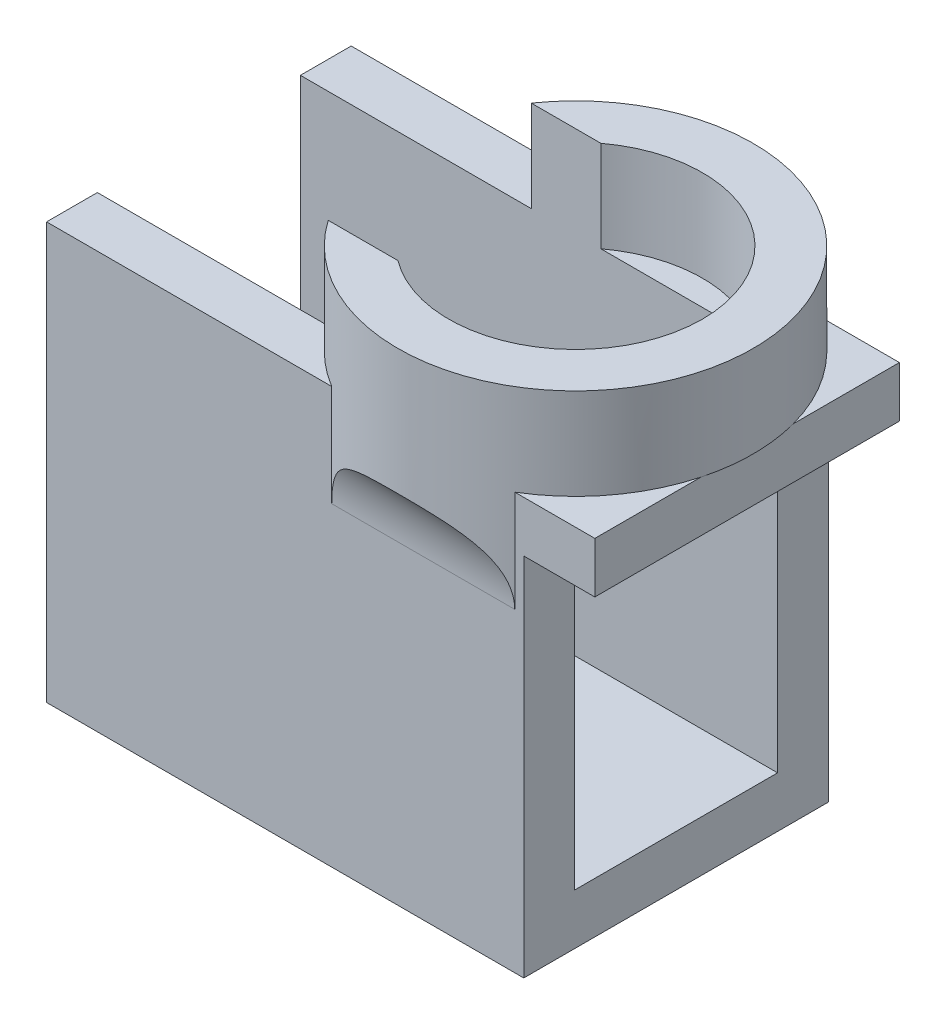
ISO-10303-21;
HEADER;
FILE_DESCRIPTION(('STEP AP214'),'2;1');
FILE_NAME('part.step','',(''),(''),'','','');
FILE_SCHEMA(('AUTOMOTIVE_DESIGN { 1 0 10303 214 1 1 1 1 }'));
ENDSEC;
DATA;
#1=APPLICATION_CONTEXT('core data for automotive mechanical design processes');
#2=APPLICATION_PROTOCOL_DEFINITION('international standard','automotive_design',2000,#1);
#3=PRODUCT_CONTEXT('',#1,'mechanical');
#4=PRODUCT('Part','Part','',(#3));
#5=PRODUCT_RELATED_PRODUCT_CATEGORY('part','',(#4));
#6=PRODUCT_DEFINITION_FORMATION('','',#4);
#7=PRODUCT_DEFINITION_CONTEXT('part definition',#1,'design');
#8=PRODUCT_DEFINITION('design','',#6,#7);
#9=PRODUCT_DEFINITION_SHAPE('','',#8);
#10=(LENGTH_UNIT() NAMED_UNIT(*) SI_UNIT(.MILLI.,.METRE.));
#11=(NAMED_UNIT(*) PLANE_ANGLE_UNIT() SI_UNIT($,.RADIAN.));
#12=(NAMED_UNIT(*) SI_UNIT($,.STERADIAN.) SOLID_ANGLE_UNIT());
#13=UNCERTAINTY_MEASURE_WITH_UNIT(LENGTH_MEASURE(1.E-05),#10,'distance_accuracy_value','');
#14=(GEOMETRIC_REPRESENTATION_CONTEXT(3) GLOBAL_UNCERTAINTY_ASSIGNED_CONTEXT((#13)) GLOBAL_UNIT_ASSIGNED_CONTEXT((#10,
#11,#12)) REPRESENTATION_CONTEXT('',''));
#15=CARTESIAN_POINT('',(0.,0.,0.));
#16=DIRECTION('',(0.,0.,1.));
#17=DIRECTION('',(1.,0.,0.));
#18=AXIS2_PLACEMENT_3D('',#15,#16,#17);
#19=CARTESIAN_POINT('',(0.,41.,0.));
#20=DIRECTION('',(0.,1.,0.));
#21=DIRECTION('',(0.,0.,1.));
#22=AXIS2_PLACEMENT_3D('',#19,#20,#21);
#23=PLANE('',#22);
#24=CARTESIAN_POINT('',(37.1,41.,-15.));
#25=DIRECTION('',(0.,1.,0.));
#26=DIRECTION('',(0.,0.,1.));
#27=AXIS2_PLACEMENT_3D('',#24,#25,#26);
#28=CIRCLE('',#27,17.5);
#29=CARTESIAN_POINT('',(22.7385933836549,41.,-5.));
#30=VERTEX_POINT('',#29);
#31=CARTESIAN_POINT('',(28.08612181134,41.,0.));
#32=VERTEX_POINT('',#31);
#33=EDGE_CURVE('E365',#30,#32,#28,.T.);
#34=ORIENTED_EDGE('',*,*,#33,.F.);
#35=DIRECTION('',(-1.,0.,0.));
#36=VECTOR('',#35,1.);
#37=CARTESIAN_POINT('',(0.,41.,-5.));
#38=LINE('',#37,#36);
#39=CARTESIAN_POINT('',(0.,41.,-5.));
#40=VERTEX_POINT('',#39);
#41=EDGE_CURVE('E273',#30,#40,#38,.T.);
#42=ORIENTED_EDGE('',*,*,#41,.T.);
#43=DIRECTION('',(0.,0.,1.));
#44=VECTOR('',#43,1.);
#45=CARTESIAN_POINT('',(0.,41.,0.));
#46=LINE('',#45,#44);
#47=CARTESIAN_POINT('',(0.,41.,0.));
#48=VERTEX_POINT('',#47);
#49=EDGE_CURVE('E264',#40,#48,#46,.T.);
#50=ORIENTED_EDGE('',*,*,#49,.T.);
#51=DIRECTION('',(1.,0.,0.));
#52=VECTOR('',#51,1.);
#53=CARTESIAN_POINT('',(0.,41.,0.));
#54=LINE('',#53,#52);
#55=EDGE_CURVE('E269',#48,#32,#54,.T.);
#56=ORIENTED_EDGE('',*,*,#55,.T.);
#57=EDGE_LOOP('',(#34,#42,#50,#56));
#58=FACE_BOUND('',#57,.T.);
#59=ADVANCED_FACE('F41',(#58),#23,.T.);
#60=CARTESIAN_POINT('',(46.11387818866,41.,0.));
#61=VERTEX_POINT('',#60);
#62=CARTESIAN_POINT('',(54.,41.,-10.4568733233598));
#63=VERTEX_POINT('',#62);
#64=EDGE_CURVE('E352',#61,#63,#28,.T.);
#65=ORIENTED_EDGE('',*,*,#64,.F.);
#66=CARTESIAN_POINT('',(54.,41.,0.));
#67=VERTEX_POINT('',#66);
#68=EDGE_CURVE('E268',#61,#67,#54,.T.);
#69=ORIENTED_EDGE('',*,*,#68,.T.);
#70=DIRECTION('',(0.,0.,-1.));
#71=VECTOR('',#70,1.);
#72=CARTESIAN_POINT('',(54.,41.,-30.));
#73=LINE('',#72,#71);
#74=EDGE_CURVE('E298',#67,#63,#73,.T.);
#75=ORIENTED_EDGE('',*,*,#74,.T.);
#76=EDGE_LOOP('',(#65,#69,#75));
#77=FACE_BOUND('',#76,.T.);
#78=ADVANCED_FACE('F153',(#77),#23,.T.);
#79=CARTESIAN_POINT('',(54.,41.,-19.5431266766402));
#80=VERTEX_POINT('',#79);
#81=CARTESIAN_POINT('',(46.11387818866,41.,-30.));
#82=VERTEX_POINT('',#81);
#83=EDGE_CURVE('E100',#80,#82,#28,.T.);
#84=ORIENTED_EDGE('',*,*,#83,.F.);
#85=CARTESIAN_POINT('',(54.,41.,-30.));
#86=VERTEX_POINT('',#85);
#87=EDGE_CURVE('E296',#80,#86,#73,.T.);
#88=ORIENTED_EDGE('',*,*,#87,.T.);
#89=DIRECTION('',(-1.,0.,0.));
#90=VECTOR('',#89,1.);
#91=CARTESIAN_POINT('',(0.,41.,-30.));
#92=LINE('',#91,#90);
#93=EDGE_CURVE('E304',#86,#82,#92,.T.);
#94=ORIENTED_EDGE('',*,*,#93,.T.);
#95=EDGE_LOOP('',(#84,#88,#94));
#96=FACE_BOUND('',#95,.T.);
#97=ADVANCED_FACE('F590',(#96),#23,.T.);
#98=CARTESIAN_POINT('',(28.08612181134,41.,-30.));
#99=VERTEX_POINT('',#98);
#100=CARTESIAN_POINT('',(22.7385933836549,41.,-25.));
#101=VERTEX_POINT('',#100);
#102=EDGE_CURVE('E441',#99,#101,#28,.T.);
#103=ORIENTED_EDGE('',*,*,#102,.F.);
#104=CARTESIAN_POINT('',(0.,41.,-30.));
#105=VERTEX_POINT('',#104);
#106=EDGE_CURVE('E302',#99,#105,#92,.T.);
#107=ORIENTED_EDGE('',*,*,#106,.T.);
#108=DIRECTION('',(0.,0.,1.));
#109=VECTOR('',#108,1.);
#110=CARTESIAN_POINT('',(0.,41.,-30.));
#111=LINE('',#110,#109);
#112=CARTESIAN_POINT('',(0.,41.,-25.));
#113=VERTEX_POINT('',#112);
#114=EDGE_CURVE('E287',#105,#113,#111,.T.);
#115=ORIENTED_EDGE('',*,*,#114,.T.);
#116=DIRECTION('',(1.,0.,0.));
#117=VECTOR('',#116,1.);
#118=CARTESIAN_POINT('',(0.,41.,-25.));
#119=LINE('',#118,#117);
#120=EDGE_CURVE('E292',#113,#101,#119,.T.);
#121=ORIENTED_EDGE('',*,*,#120,.T.);
#122=EDGE_LOOP('',(#103,#107,#115,#121));
#123=FACE_BOUND('',#122,.T.);
#124=ADVANCED_FACE('F524',(#123),#23,.T.);
#125=CARTESIAN_POINT('',(37.1,41.,-15.));
#126=DIRECTION('',(0.,-1.,0.));
#127=DIRECTION('',(0.,0.,1.));
#128=AXIS2_PLACEMENT_3D('',#125,#126,#127);
#129=CIRCLE('',#128,12.5);
#130=CARTESIAN_POINT('',(29.6,41.,-25.));
#131=VERTEX_POINT('',#130);
#132=CARTESIAN_POINT('',(44.6,41.,-25.));
#133=VERTEX_POINT('',#132);
#134=EDGE_CURVE('E459',#131,#133,#129,.T.);
#135=ORIENTED_EDGE('',*,*,#134,.F.);
#136=EDGE_CURVE('E297',#131,#133,#119,.T.);
#137=ORIENTED_EDGE('',*,*,#136,.T.);
#138=EDGE_LOOP('',(#135,#137));
#139=FACE_BOUND('',#138,.T.);
#140=ADVANCED_FACE('F538',(#139),#23,.T.);
#141=CARTESIAN_POINT('',(47.,41.,-22.6315136113356));
#142=VERTEX_POINT('',#141);
#143=CARTESIAN_POINT('',(47.,41.,-7.36848638866444));
#144=VERTEX_POINT('',#143);
#145=EDGE_CURVE('E447',#142,#144,#129,.T.);
#146=ORIENTED_EDGE('',*,*,#145,.F.);
#147=DIRECTION('',(0.,0.,1.));
#148=VECTOR('',#147,1.);
#149=CARTESIAN_POINT('',(47.,41.,-25.));
#150=LINE('',#149,#148);
#151=EDGE_CURVE('E253',#142,#144,#150,.T.);
#152=ORIENTED_EDGE('',*,*,#151,.T.);
#153=EDGE_LOOP('',(#146,#152));
#154=FACE_BOUND('',#153,.T.);
#155=ADVANCED_FACE('F581',(#154),#23,.T.);
#156=CARTESIAN_POINT('',(44.6,41.,-5.));
#157=VERTEX_POINT('',#156);
#158=CARTESIAN_POINT('',(29.6,41.,-5.));
#159=VERTEX_POINT('',#158);
#160=EDGE_CURVE('E346',#157,#159,#129,.T.);
#161=ORIENTED_EDGE('',*,*,#160,.F.);
#162=EDGE_CURVE('E279',#157,#159,#38,.T.);
#163=ORIENTED_EDGE('',*,*,#162,.T.);
#164=EDGE_LOOP('',(#161,#163));
#165=FACE_BOUND('',#164,.T.);
#166=ADVANCED_FACE('F145',(#165),#23,.T.);
#167=CARTESIAN_POINT('',(0.,5.,0.));
#168=DIRECTION('',(0.,-1.,0.));
#169=DIRECTION('',(0.,0.,-1.));
#170=AXIS2_PLACEMENT_3D('',#167,#168,#169);
#171=PLANE('',#170);
#172=DIRECTION('',(-1.,0.,0.));
#173=VECTOR('',#172,1.);
#174=CARTESIAN_POINT('',(0.,5.,-5.));
#175=LINE('',#174,#173);
#176=CARTESIAN_POINT('',(47.,5.,-5.));
#177=VERTEX_POINT('',#176);
#178=CARTESIAN_POINT('',(0.,5.,-5.));
#179=VERTEX_POINT('',#178);
#180=EDGE_CURVE('E258',#177,#179,#175,.T.);
#181=ORIENTED_EDGE('',*,*,#180,.F.);
#182=DIRECTION('',(0.,0.,-1.));
#183=VECTOR('',#182,1.);
#184=CARTESIAN_POINT('',(47.,5.,0.));
#185=LINE('',#184,#183);
#186=CARTESIAN_POINT('',(47.,5.,-25.));
#187=VERTEX_POINT('',#186);
#188=EDGE_CURVE('E240',#177,#187,#185,.T.);
#189=ORIENTED_EDGE('',*,*,#188,.T.);
#190=DIRECTION('',(1.,0.,0.));
#191=VECTOR('',#190,1.);
#192=CARTESIAN_POINT('',(0.,5.,-25.));
#193=LINE('',#192,#191);
#194=CARTESIAN_POINT('',(0.,5.,-25.));
#195=VERTEX_POINT('',#194);
#196=EDGE_CURVE('E286',#195,#187,#193,.T.);
#197=ORIENTED_EDGE('',*,*,#196,.F.);
#198=DIRECTION('',(0.,0.,1.));
#199=VECTOR('',#198,1.);
#200=CARTESIAN_POINT('',(0.,5.,0.));
#201=LINE('',#200,#199);
#202=EDGE_CURVE('E315',#195,#179,#201,.T.);
#203=ORIENTED_EDGE('',*,*,#202,.T.);
#204=EDGE_LOOP('',(#181,#189,#197,#203));
#205=FACE_BOUND('',#204,.T.);
#206=ADVANCED_FACE('F127',(#205),#171,.F.);
#207=CARTESIAN_POINT('',(0.,5.,0.));
#208=DIRECTION('',(1.,0.,0.));
#209=DIRECTION('',(0.,0.,-1.));
#210=AXIS2_PLACEMENT_3D('',#207,#208,#209);
#211=PLANE('',#210);
#212=CARTESIAN_POINT('',(0.,5.,-27.5));
#213=DIRECTION('',(-1.,0.,0.));
#214=DIRECTION('',(0.,0.,1.));
#215=AXIS2_PLACEMENT_3D('',#212,#213,#214);
#216=CIRCLE('',#215,1.5);
#217=CARTESIAN_POINT('',(0.,5.,-26.));
#218=VERTEX_POINT('',#217);
#219=EDGE_CURVE('E197',#218,#218,#216,.T.);
#220=ORIENTED_EDGE('',*,*,#219,.F.);
#221=EDGE_LOOP('',(#220));
#222=FACE_BOUND('',#221,.T.);
#223=CARTESIAN_POINT('',(0.,5.,-2.5));
#224=DIRECTION('',(-1.,0.,0.));
#225=DIRECTION('',(0.,0.,1.));
#226=AXIS2_PLACEMENT_3D('',#223,#224,#225);
#227=CIRCLE('',#226,1.5);
#228=CARTESIAN_POINT('',(0.,5.,-0.999999999999998));
#229=VERTEX_POINT('',#228);
#230=EDGE_CURVE('E214',#229,#229,#227,.T.);
#231=ORIENTED_EDGE('',*,*,#230,.F.);
#232=EDGE_LOOP('',(#231));
#233=FACE_BOUND('',#232,.T.);
#234=DIRECTION('',(0.,0.,1.));
#235=VECTOR('',#234,1.);
#236=CARTESIAN_POINT('',(0.,0.,0.));
#237=LINE('',#236,#235);
#238=CARTESIAN_POINT('',(0.,0.,-30.));
#239=VERTEX_POINT('',#238);
#240=CARTESIAN_POINT('',(0.,0.,0.));
#241=VERTEX_POINT('',#240);
#242=EDGE_CURVE('E314',#239,#241,#237,.T.);
#243=ORIENTED_EDGE('',*,*,#242,.T.);
#244=DIRECTION('',(0.,-1.,0.));
#245=VECTOR('',#244,1.);
#246=CARTESIAN_POINT('',(0.,5.,0.));
#247=LINE('',#246,#245);
#248=EDGE_CURVE('E342',#48,#241,#247,.T.);
#249=ORIENTED_EDGE('',*,*,#248,.F.);
#250=ORIENTED_EDGE('',*,*,#49,.F.);
#251=DIRECTION('',(0.,-1.,0.));
#252=VECTOR('',#251,1.);
#253=CARTESIAN_POINT('',(0.,41.,-5.));
#254=LINE('',#253,#252);
#255=EDGE_CURVE('E278',#40,#179,#254,.T.);
#256=ORIENTED_EDGE('',*,*,#255,.T.);
#257=ORIENTED_EDGE('',*,*,#202,.F.);
#258=DIRECTION('',(0.,-1.,0.));
#259=VECTOR('',#258,1.);
#260=CARTESIAN_POINT('',(0.,41.,-25.));
#261=LINE('',#260,#259);
#262=EDGE_CURVE('E307',#113,#195,#261,.T.);
#263=ORIENTED_EDGE('',*,*,#262,.F.);
#264=ORIENTED_EDGE('',*,*,#114,.F.);
#265=DIRECTION('',(0.,-1.,0.));
#266=VECTOR('',#265,1.);
#267=CARTESIAN_POINT('',(0.,5.,-30.));
#268=LINE('',#267,#266);
#269=EDGE_CURVE('E319',#105,#239,#268,.T.);
#270=ORIENTED_EDGE('',*,*,#269,.T.);
#271=EDGE_LOOP('',(#243,#249,#250,#256,#257,#263,#264,#270));
#272=FACE_BOUND('',#271,.T.);
#273=ADVANCED_FACE('F123',(#222,#233,#272),#211,.F.);
#274=CARTESIAN_POINT('',(0.,5.,0.));
#275=DIRECTION('',(0.,0.,-1.));
#276=DIRECTION('',(-1.,0.,0.));
#277=AXIS2_PLACEMENT_3D('',#274,#275,#276);
#278=PLANE('',#277);
#279=ORIENTED_EDGE('',*,*,#68,.F.);
#280=DIRECTION('',(0.,-1.,0.));
#281=VECTOR('',#280,1.);
#282=CARTESIAN_POINT('',(46.11387818866,41.,0.));
#283=LINE('',#282,#281);
#284=CARTESIAN_POINT('',(46.11387818866,31.,0.));
#285=VERTEX_POINT('',#284);
#286=EDGE_CURVE('E102',#61,#285,#283,.T.);
#287=ORIENTED_EDGE('',*,*,#286,.T.);
#288=DIRECTION('',(1.,0.,0.));
#289=VECTOR('',#288,1.);
#290=CARTESIAN_POINT('',(28.08612181134,31.,0.));
#291=LINE('',#290,#289);
#292=CARTESIAN_POINT('',(28.08612181134,31.,0.));
#293=VERTEX_POINT('',#292);
#294=EDGE_CURVE('E351',#285,#293,#291,.F.);
#295=ORIENTED_EDGE('',*,*,#294,.T.);
#296=DIRECTION('',(0.,-1.,0.));
#297=VECTOR('',#296,1.);
#298=CARTESIAN_POINT('',(28.08612181134,31.,0.));
#299=LINE('',#298,#297);
#300=EDGE_CURVE('E347',#293,#32,#299,.F.);
#301=ORIENTED_EDGE('',*,*,#300,.T.);
#302=ORIENTED_EDGE('',*,*,#55,.F.);
#303=ORIENTED_EDGE('',*,*,#248,.T.);
#304=DIRECTION('',(1.,0.,0.));
#305=VECTOR('',#304,1.);
#306=CARTESIAN_POINT('',(0.,0.,0.));
#307=LINE('',#306,#305);
#308=CARTESIAN_POINT('',(47.,0.,0.));
#309=VERTEX_POINT('',#308);
#310=EDGE_CURVE('E324',#241,#309,#307,.T.);
#311=ORIENTED_EDGE('',*,*,#310,.T.);
#312=DIRECTION('',(0.,-1.,0.));
#313=VECTOR('',#312,1.);
#314=CARTESIAN_POINT('',(47.,36.,0.));
#315=LINE('',#314,#313);
#316=CARTESIAN_POINT('',(47.,36.,0.));
#317=VERTEX_POINT('',#316);
#318=EDGE_CURVE('E234',#317,#309,#315,.T.);
#319=ORIENTED_EDGE('',*,*,#318,.F.);
#320=DIRECTION('',(-1.,0.,0.));
#321=VECTOR('',#320,1.);
#322=CARTESIAN_POINT('',(54.,36.,0.));
#323=LINE('',#322,#321);
#324=CARTESIAN_POINT('',(54.,36.,0.));
#325=VERTEX_POINT('',#324);
#326=EDGE_CURVE('E221',#325,#317,#323,.T.);
#327=ORIENTED_EDGE('',*,*,#326,.F.);
#328=DIRECTION('',(0.,-1.,0.));
#329=VECTOR('',#328,1.);
#330=CARTESIAN_POINT('',(54.,5.,0.));
#331=LINE('',#330,#329);
#332=EDGE_CURVE('E338',#67,#325,#331,.T.);
#333=ORIENTED_EDGE('',*,*,#332,.F.);
#334=EDGE_LOOP('',(#279,#287,#295,#301,#302,#303,#311,#319,#327,#333));
#335=FACE_BOUND('',#334,.T.);
#336=ADVANCED_FACE('F126',(#335),#278,.F.);
#337=CARTESIAN_POINT('',(54.,5.,0.));
#338=DIRECTION('',(-1.,0.,0.));
#339=DIRECTION('',(0.,0.,1.));
#340=AXIS2_PLACEMENT_3D('',#337,#338,#339);
#341=PLANE('',#340);
#342=ORIENTED_EDGE('',*,*,#332,.T.);
#343=DIRECTION('',(0.,0.,1.));
#344=VECTOR('',#343,1.);
#345=CARTESIAN_POINT('',(54.,36.,0.));
#346=LINE('',#345,#344);
#347=CARTESIAN_POINT('',(54.,36.,-30.));
#348=VERTEX_POINT('',#347);
#349=EDGE_CURVE('E202',#348,#325,#346,.T.);
#350=ORIENTED_EDGE('',*,*,#349,.F.);
#351=DIRECTION('',(0.,-1.,0.));
#352=VECTOR('',#351,1.);
#353=CARTESIAN_POINT('',(54.,5.,-30.));
#354=LINE('',#353,#352);
#355=EDGE_CURVE('E334',#86,#348,#354,.T.);
#356=ORIENTED_EDGE('',*,*,#355,.F.);
#357=ORIENTED_EDGE('',*,*,#87,.F.);
#358=EDGE_CURVE('E303',#63,#80,#73,.T.);
#359=ORIENTED_EDGE('',*,*,#358,.F.);
#360=ORIENTED_EDGE('',*,*,#74,.F.);
#361=EDGE_LOOP('',(#342,#350,#356,#357,#359,#360));
#362=FACE_BOUND('',#361,.T.);
#363=ADVANCED_FACE('F131',(#362),#341,.F.);
#364=CARTESIAN_POINT('',(0.,5.,-30.));
#365=DIRECTION('',(0.,0.,1.));
#366=DIRECTION('',(1.,0.,0.));
#367=AXIS2_PLACEMENT_3D('',#364,#365,#366);
#368=PLANE('',#367);
#369=ORIENTED_EDGE('',*,*,#106,.F.);
#370=DIRECTION('',(0.,-1.,0.));
#371=VECTOR('',#370,1.);
#372=CARTESIAN_POINT('',(28.08612181134,41.,-30.));
#373=LINE('',#372,#371);
#374=CARTESIAN_POINT('',(28.08612181134,31.,-30.));
#375=VERTEX_POINT('',#374);
#376=EDGE_CURVE('E64',#99,#375,#373,.T.);
#377=ORIENTED_EDGE('',*,*,#376,.T.);
#378=DIRECTION('',(-1.,0.,0.));
#379=VECTOR('',#378,1.);
#380=CARTESIAN_POINT('',(46.11387818866,31.,-30.));
#381=LINE('',#380,#379);
#382=CARTESIAN_POINT('',(46.11387818866,31.,-30.));
#383=VERTEX_POINT('',#382);
#384=EDGE_CURVE('E95',#375,#383,#381,.F.);
#385=ORIENTED_EDGE('',*,*,#384,.T.);
#386=DIRECTION('',(0.,-1.,0.));
#387=VECTOR('',#386,1.);
#388=CARTESIAN_POINT('',(46.11387818866,31.,-30.));
#389=LINE('',#388,#387);
#390=EDGE_CURVE('E86',#383,#82,#389,.F.);
#391=ORIENTED_EDGE('',*,*,#390,.T.);
#392=ORIENTED_EDGE('',*,*,#93,.F.);
#393=ORIENTED_EDGE('',*,*,#355,.T.);
#394=DIRECTION('',(1.,0.,0.));
#395=VECTOR('',#394,1.);
#396=CARTESIAN_POINT('',(54.,36.,-30.));
#397=LINE('',#396,#395);
#398=CARTESIAN_POINT('',(47.,36.,-30.));
#399=VERTEX_POINT('',#398);
#400=EDGE_CURVE('E230',#399,#348,#397,.T.);
#401=ORIENTED_EDGE('',*,*,#400,.F.);
#402=DIRECTION('',(0.,-1.,0.));
#403=VECTOR('',#402,1.);
#404=CARTESIAN_POINT('',(47.,36.,-30.));
#405=LINE('',#404,#403);
#406=CARTESIAN_POINT('',(47.,0.,-30.));
#407=VERTEX_POINT('',#406);
#408=EDGE_CURVE('E236',#399,#407,#405,.T.);
#409=ORIENTED_EDGE('',*,*,#408,.T.);
#410=DIRECTION('',(-1.,0.,0.));
#411=VECTOR('',#410,1.);
#412=CARTESIAN_POINT('',(0.,0.,-30.));
#413=LINE('',#412,#411);
#414=EDGE_CURVE('E320',#407,#239,#413,.T.);
#415=ORIENTED_EDGE('',*,*,#414,.T.);
#416=ORIENTED_EDGE('',*,*,#269,.F.);
#417=EDGE_LOOP('',(#369,#377,#385,#391,#392,#393,#401,#409,#415,#416));
#418=FACE_BOUND('',#417,.T.);
#419=ADVANCED_FACE('F104',(#418),#368,.F.);
#420=CARTESIAN_POINT('',(0.,0.,0.));
#421=DIRECTION('',(0.,-1.,0.));
#422=DIRECTION('',(0.,0.,-1.));
#423=AXIS2_PLACEMENT_3D('',#420,#421,#422);
#424=PLANE('',#423);
#425=DIRECTION('',(0.,0.,-1.));
#426=VECTOR('',#425,1.);
#427=CARTESIAN_POINT('',(47.,0.,0.));
#428=LINE('',#427,#426);
#429=EDGE_CURVE('E196',#309,#407,#428,.T.);
#430=ORIENTED_EDGE('',*,*,#429,.F.);
#431=ORIENTED_EDGE('',*,*,#310,.F.);
#432=ORIENTED_EDGE('',*,*,#242,.F.);
#433=ORIENTED_EDGE('',*,*,#414,.F.);
#434=EDGE_LOOP('',(#430,#431,#432,#433));
#435=FACE_BOUND('',#434,.T.);
#436=ADVANCED_FACE('F138',(#435),#424,.T.);
#437=CARTESIAN_POINT('',(0.,41.,-25.));
#438=DIRECTION('',(0.,0.,-1.));
#439=DIRECTION('',(-1.,0.,0.));
#440=AXIS2_PLACEMENT_3D('',#437,#438,#439);
#441=PLANE('',#440);
#442=ORIENTED_EDGE('',*,*,#196,.T.);
#443=DIRECTION('',(0.,1.,0.));
#444=VECTOR('',#443,1.);
#445=CARTESIAN_POINT('',(47.,31.,-25.));
#446=LINE('',#445,#444);
#447=CARTESIAN_POINT('',(47.,36.,-25.));
#448=VERTEX_POINT('',#447);
#449=EDGE_CURVE('E254',#187,#448,#446,.T.);
#450=ORIENTED_EDGE('',*,*,#449,.T.);
#451=CARTESIAN_POINT('',(47.,41.,-25.));
#452=VERTEX_POINT('',#451);
#453=EDGE_CURVE('E259',#448,#452,#446,.T.);
#454=ORIENTED_EDGE('',*,*,#453,.T.);
#455=EDGE_CURVE('E291',#133,#452,#119,.T.);
#456=ORIENTED_EDGE('',*,*,#455,.F.);
#457=ORIENTED_EDGE('',*,*,#136,.F.);
#458=DIRECTION('',(0.,-1.,0.));
#459=VECTOR('',#458,1.);
#460=CARTESIAN_POINT('',(29.6,50.,-25.));
#461=LINE('',#460,#459);
#462=CARTESIAN_POINT('',(29.6,50.,-25.));
#463=VERTEX_POINT('',#462);
#464=EDGE_CURVE('E540',#463,#131,#461,.T.);
#465=ORIENTED_EDGE('',*,*,#464,.F.);
#466=DIRECTION('',(1.,0.,0.));
#467=VECTOR('',#466,1.);
#468=CARTESIAN_POINT('',(22.7385933836549,50.,-25.));
#469=LINE('',#468,#467);
#470=CARTESIAN_POINT('',(22.7385933836549,50.,-25.));
#471=VERTEX_POINT('',#470);
#472=EDGE_CURVE('E559',#471,#463,#469,.T.);
#473=ORIENTED_EDGE('',*,*,#472,.F.);
#474=DIRECTION('',(0.,-1.,0.));
#475=VECTOR('',#474,1.);
#476=CARTESIAN_POINT('',(22.7385933836549,50.,-25.));
#477=LINE('',#476,#475);
#478=EDGE_CURVE('E208',#471,#101,#477,.T.);
#479=ORIENTED_EDGE('',*,*,#478,.T.);
#480=ORIENTED_EDGE('',*,*,#120,.F.);
#481=ORIENTED_EDGE('',*,*,#262,.T.);
#482=EDGE_LOOP('',(#442,#450,#454,#456,#457,#465,#473,#479,#480,#481));
#483=FACE_BOUND('',#482,.T.);
#484=ADVANCED_FACE('F141',(#483),#441,.F.);
#485=CARTESIAN_POINT('',(0.,41.,-5.));
#486=DIRECTION('',(0.,0.,1.));
#487=DIRECTION('',(1.,0.,0.));
#488=AXIS2_PLACEMENT_3D('',#485,#486,#487);
#489=PLANE('',#488);
#490=DIRECTION('',(0.,1.,0.));
#491=VECTOR('',#490,1.);
#492=CARTESIAN_POINT('',(47.,31.,-5.));
#493=LINE('',#492,#491);
#494=CARTESIAN_POINT('',(47.,36.,-5.));
#495=VERTEX_POINT('',#494);
#496=EDGE_CURVE('E260',#177,#495,#493,.T.);
#497=ORIENTED_EDGE('',*,*,#496,.F.);
#498=ORIENTED_EDGE('',*,*,#180,.T.);
#499=ORIENTED_EDGE('',*,*,#255,.F.);
#500=ORIENTED_EDGE('',*,*,#41,.F.);
#501=DIRECTION('',(0.,-1.,0.));
#502=VECTOR('',#501,1.);
#503=CARTESIAN_POINT('',(22.7385933836549,50.,-5.));
#504=LINE('',#503,#502);
#505=CARTESIAN_POINT('',(22.7385933836549,50.,-5.));
#506=VERTEX_POINT('',#505);
#507=EDGE_CURVE('E548',#506,#30,#504,.T.);
#508=ORIENTED_EDGE('',*,*,#507,.F.);
#509=DIRECTION('',(-1.,0.,0.));
#510=VECTOR('',#509,1.);
#511=CARTESIAN_POINT('',(22.7385933836549,50.,-5.));
#512=LINE('',#511,#510);
#513=CARTESIAN_POINT('',(29.6,50.,-5.));
#514=VERTEX_POINT('',#513);
#515=EDGE_CURVE('E551',#514,#506,#512,.T.);
#516=ORIENTED_EDGE('',*,*,#515,.F.);
#517=DIRECTION('',(0.,-1.,0.));
#518=VECTOR('',#517,1.);
#519=CARTESIAN_POINT('',(29.6,50.,-5.));
#520=LINE('',#519,#518);
#521=EDGE_CURVE('E480',#514,#159,#520,.T.);
#522=ORIENTED_EDGE('',*,*,#521,.T.);
#523=ORIENTED_EDGE('',*,*,#162,.F.);
#524=CARTESIAN_POINT('',(47.,41.,-5.));
#525=VERTEX_POINT('',#524);
#526=EDGE_CURVE('E274',#525,#157,#38,.T.);
#527=ORIENTED_EDGE('',*,*,#526,.F.);
#528=EDGE_CURVE('E252',#495,#525,#493,.T.);
#529=ORIENTED_EDGE('',*,*,#528,.F.);
#530=EDGE_LOOP('',(#497,#498,#499,#500,#508,#516,#522,#523,#527,#529));
#531=FACE_BOUND('',#530,.T.);
#532=ADVANCED_FACE('F149',(#531),#489,.F.);
#533=CARTESIAN_POINT('',(47.,31.,-25.));
#534=DIRECTION('',(-1.,0.,0.));
#535=DIRECTION('',(0.,0.,1.));
#536=AXIS2_PLACEMENT_3D('',#533,#534,#535);
#537=PLANE('',#536);
#538=DIRECTION('',(0.,0.,-1.));
#539=VECTOR('',#538,1.);
#540=CARTESIAN_POINT('',(47.,36.,0.));
#541=LINE('',#540,#539);
#542=EDGE_CURVE('E231',#495,#448,#541,.T.);
#543=ORIENTED_EDGE('',*,*,#542,.F.);
#544=ORIENTED_EDGE('',*,*,#528,.T.);
#545=EDGE_CURVE('E247',#144,#525,#150,.T.);
#546=ORIENTED_EDGE('',*,*,#545,.F.);
#547=ORIENTED_EDGE('',*,*,#151,.F.);
#548=EDGE_CURVE('E248',#452,#142,#150,.T.);
#549=ORIENTED_EDGE('',*,*,#548,.F.);
#550=ORIENTED_EDGE('',*,*,#453,.F.);
#551=EDGE_LOOP('',(#543,#544,#546,#547,#549,#550));
#552=FACE_BOUND('',#551,.T.);
#553=ADVANCED_FACE('F157',(#552),#537,.T.);
#554=CARTESIAN_POINT('',(47.,36.,0.));
#555=DIRECTION('',(-1.,0.,0.));
#556=DIRECTION('',(0.,0.,1.));
#557=AXIS2_PLACEMENT_3D('',#554,#555,#556);
#558=PLANE('',#557);
#559=EDGE_CURVE('E226',#317,#495,#541,.T.);
#560=ORIENTED_EDGE('',*,*,#559,.F.);
#561=ORIENTED_EDGE('',*,*,#318,.T.);
#562=ORIENTED_EDGE('',*,*,#429,.T.);
#563=ORIENTED_EDGE('',*,*,#408,.F.);
#564=EDGE_CURVE('E225',#448,#399,#541,.T.);
#565=ORIENTED_EDGE('',*,*,#564,.F.);
#566=ORIENTED_EDGE('',*,*,#449,.F.);
#567=ORIENTED_EDGE('',*,*,#188,.F.);
#568=ORIENTED_EDGE('',*,*,#496,.T.);
#569=EDGE_LOOP('',(#560,#561,#562,#563,#565,#566,#567,#568));
#570=FACE_BOUND('',#569,.T.);
#571=ADVANCED_FACE('F161',(#570),#558,.F.);
#572=CARTESIAN_POINT('',(0.,36.,0.));
#573=DIRECTION('',(0.,1.,0.));
#574=DIRECTION('',(0.,0.,1.));
#575=AXIS2_PLACEMENT_3D('',#572,#573,#574);
#576=PLANE('',#575);
#577=ORIENTED_EDGE('',*,*,#349,.T.);
#578=ORIENTED_EDGE('',*,*,#326,.T.);
#579=ORIENTED_EDGE('',*,*,#559,.T.);
#580=ORIENTED_EDGE('',*,*,#542,.T.);
#581=ORIENTED_EDGE('',*,*,#564,.T.);
#582=ORIENTED_EDGE('',*,*,#400,.T.);
#583=EDGE_LOOP('',(#577,#578,#579,#580,#581,#582));
#584=FACE_BOUND('',#583,.T.);
#585=ADVANCED_FACE('F165',(#584),#576,.F.);
#586=CARTESIAN_POINT('',(5.,5.,-2.5));
#587=DIRECTION('',(-1.,0.,0.));
#588=DIRECTION('',(0.,0.,1.));
#589=AXIS2_PLACEMENT_3D('',#586,#587,#588);
#590=CYLINDRICAL_SURFACE('',#589,1.5);
#591=CARTESIAN_POINT('',(5.,5.,-2.5));
#592=DIRECTION('',(-1.,0.,0.));
#593=DIRECTION('',(0.,0.,1.));
#594=AXIS2_PLACEMENT_3D('',#591,#592,#593);
#595=CIRCLE('',#594,1.5);
#596=CARTESIAN_POINT('',(5.,5.,-0.999999999999998));
#597=VERTEX_POINT('',#596);
#598=EDGE_CURVE('E205',#597,#597,#595,.T.);
#599=ORIENTED_EDGE('',*,*,#598,.F.);
#600=EDGE_LOOP('',(#599));
#601=FACE_BOUND('',#600,.T.);
#602=ORIENTED_EDGE('',*,*,#230,.T.);
#603=EDGE_LOOP('',(#602));
#604=FACE_BOUND('',#603,.T.);
#605=ADVANCED_FACE('F169',(#601,#604),#590,.F.);
#606=CARTESIAN_POINT('',(5.,5.,-2.5));
#607=DIRECTION('',(-1.,0.,0.));
#608=DIRECTION('',(0.,0.,1.));
#609=AXIS2_PLACEMENT_3D('',#606,#607,#608);
#610=PLANE('',#609);
#611=ORIENTED_EDGE('',*,*,#598,.T.);
#612=EDGE_LOOP('',(#611));
#613=FACE_BOUND('',#612,.T.);
#614=ADVANCED_FACE('F173',(#613),#610,.T.);
#615=CARTESIAN_POINT('',(5.,5.,-27.5));
#616=DIRECTION('',(-1.,0.,0.));
#617=DIRECTION('',(0.,0.,1.));
#618=AXIS2_PLACEMENT_3D('',#615,#616,#617);
#619=CYLINDRICAL_SURFACE('',#618,1.5);
#620=CARTESIAN_POINT('',(5.,5.,-27.5));
#621=DIRECTION('',(-1.,0.,0.));
#622=DIRECTION('',(0.,0.,1.));
#623=AXIS2_PLACEMENT_3D('',#620,#621,#622);
#624=CIRCLE('',#623,1.5);
#625=CARTESIAN_POINT('',(5.,5.,-26.));
#626=VERTEX_POINT('',#625);
#627=EDGE_CURVE('E194',#626,#626,#624,.T.);
#628=ORIENTED_EDGE('',*,*,#627,.F.);
#629=EDGE_LOOP('',(#628));
#630=FACE_BOUND('',#629,.T.);
#631=ORIENTED_EDGE('',*,*,#219,.T.);
#632=EDGE_LOOP('',(#631));
#633=FACE_BOUND('',#632,.T.);
#634=ADVANCED_FACE('F177',(#630,#633),#619,.F.);
#635=CARTESIAN_POINT('',(5.,5.,-27.5));
#636=DIRECTION('',(-1.,0.,0.));
#637=DIRECTION('',(0.,0.,1.));
#638=AXIS2_PLACEMENT_3D('',#635,#636,#637);
#639=PLANE('',#638);
#640=ORIENTED_EDGE('',*,*,#627,.T.);
#641=EDGE_LOOP('',(#640));
#642=FACE_BOUND('',#641,.T.);
#643=ADVANCED_FACE('F180',(#642),#639,.T.);
#644=CARTESIAN_POINT('',(37.1,41.,-15.));
#645=DIRECTION('',(0.,1.,0.));
#646=DIRECTION('',(0.,0.,1.));
#647=AXIS2_PLACEMENT_3D('',#644,#645,#646);
#648=PLANE('',#647);
#649=EDGE_CURVE('E453',#133,#142,#129,.T.);
#650=ORIENTED_EDGE('',*,*,#649,.F.);
#651=ORIENTED_EDGE('',*,*,#455,.T.);
#652=ORIENTED_EDGE('',*,*,#548,.T.);
#653=EDGE_LOOP('',(#650,#651,#652));
#654=FACE_BOUND('',#653,.T.);
#655=ADVANCED_FACE('F183',(#654),#648,.F.);
#656=EDGE_CURVE('E440',#144,#157,#129,.T.);
#657=ORIENTED_EDGE('',*,*,#656,.F.);
#658=ORIENTED_EDGE('',*,*,#545,.T.);
#659=ORIENTED_EDGE('',*,*,#526,.T.);
#660=EDGE_LOOP('',(#657,#658,#659));
#661=FACE_BOUND('',#660,.T.);
#662=ADVANCED_FACE('F188',(#661),#648,.F.);
#663=EDGE_CURVE('E436',#63,#80,#28,.T.);
#664=ORIENTED_EDGE('',*,*,#663,.F.);
#665=ORIENTED_EDGE('',*,*,#358,.T.);
#666=EDGE_LOOP('',(#664,#665));
#667=FACE_BOUND('',#666,.T.);
#668=ADVANCED_FACE('F191',(#667),#648,.F.);
#669=CARTESIAN_POINT('',(37.1,50.,-15.));
#670=DIRECTION('',(0.,-1.,0.));
#671=DIRECTION('',(0.,0.,-1.));
#672=AXIS2_PLACEMENT_3D('',#669,#670,#671);
#673=CYLINDRICAL_SURFACE('',#672,17.5);
#674=ORIENTED_EDGE('',*,*,#33,.T.);
#675=ORIENTED_EDGE('',*,*,#300,.F.);
#676=CARTESIAN_POINT('',(28.08612181134,31.,0.));
#677=CARTESIAN_POINT('',(28.0860939070164,31.1665418513179,-4.37429430990452E-05));
#678=CARTESIAN_POINT('',(28.093043439622,31.3330663552599,0.00415869317904868));
#679=CARTESIAN_POINT('',(28.1206895773268,31.6644809721373,0.0207343091881698));
#680=CARTESIAN_POINT('',(28.1413794493952,31.8293718454386,0.0331034871972513));
#681=CARTESIAN_POINT('',(28.1961195708853,32.1550191425485,0.0655851821914614));
#682=CARTESIAN_POINT('',(28.2300817188553,32.3157955297215,0.0856466216860005));
#683=CARTESIAN_POINT('',(28.3109900267623,32.6329687072894,0.132928013225183));
#684=CARTESIAN_POINT('',(28.3579369149116,32.7893652515112,0.160148366752951));
#685=CARTESIAN_POINT('',(28.4642271563886,33.0963126075109,0.220944741949563));
#686=CARTESIAN_POINT('',(28.523550817122,33.246872260417,0.254510659367984));
#687=CARTESIAN_POINT('',(28.6540486457482,33.5414511337117,0.327148549411994));
#688=CARTESIAN_POINT('',(28.725228233115,33.6854673245174,0.366223038805575));
#689=CARTESIAN_POINT('',(28.8787508981822,33.9661406270347,0.448904598659306));
#690=CARTESIAN_POINT('',(28.9610992318409,34.1027942313876,0.492513800865579));
#691=CARTESIAN_POINT('',(29.1361583439367,34.368096436779,0.583227323780372));
#692=CARTESIAN_POINT('',(29.228873277119,34.4967417958702,0.630333043268819));
#693=CARTESIAN_POINT('',(29.5182884480425,34.8660713354468,0.7738178454822));
#694=CARTESIAN_POINT('',(29.7288000793962,35.0947192705041,0.87377086430731));
#695=CARTESIAN_POINT('',(30.1803540863088,35.5180685326273,1.07574752530892));
#696=CARTESIAN_POINT('',(30.4214042052407,35.7127612201013,1.17777168711762));
#697=CARTESIAN_POINT('',(30.8643783798239,36.024593221552,1.35263803946422));
#698=CARTESIAN_POINT('',(31.0609560138961,36.1489373565016,1.42638248155768));
#699=CARTESIAN_POINT('',(31.4656856681566,36.3801783723864,1.5695673541876));
#700=CARTESIAN_POINT('',(31.6738418497563,36.4870689253489,1.63900621805859));
#701=CARTESIAN_POINT('',(32.1000515619902,36.684581113944,1.77201444396052));
#702=CARTESIAN_POINT('',(32.3181244947959,36.7751689723966,1.83557149028152));
#703=CARTESIAN_POINT('',(32.7619768096376,36.9409006923707,1.95536587147115));
#704=CARTESIAN_POINT('',(32.9877564918561,37.0160439515137,2.01160292080996));
#705=CARTESIAN_POINT('',(33.5258935424131,37.1758039897639,2.13406681860795));
#706=CARTESIAN_POINT('',(33.8408094488526,37.25447985944,2.19686590859638));
#707=CARTESIAN_POINT('',(34.4785958044811,37.387740737717,2.3055775629558));
#708=CARTESIAN_POINT('',(34.8014692067982,37.4423166559353,2.35148375432253));
#709=CARTESIAN_POINT('',(35.4524286024998,37.5290078057822,2.42535160406917));
#710=CARTESIAN_POINT('',(35.7805176906007,37.5611091515487,2.4533021677291));
#711=CARTESIAN_POINT('',(36.4390765802678,37.6037929806268,2.4906242451795));
#712=CARTESIAN_POINT('',(36.7695459474448,37.6143792952345,2.49999906684385));
#713=CARTESIAN_POINT('',(37.401615794167,37.6143773488906,2.50000085172095));
#714=CARTESIAN_POINT('',(37.7032188300499,37.6055563399161,2.4921925172323));
#715=CARTESIAN_POINT('',(38.3045869940969,37.5700362869659,2.46108827444595));
#716=CARTESIAN_POINT('',(38.6043521072025,37.5433370967071,2.43779223942468));
#717=CARTESIAN_POINT('',(39.1998345235586,37.4713979710139,2.3761394372844));
#718=CARTESIAN_POINT('',(39.4955550590295,37.4261738573883,2.33779552346122));
#719=CARTESIAN_POINT('',(40.0810601590937,37.3160514960825,2.24676763433998));
#720=CARTESIAN_POINT('',(40.3708457642785,37.2511567294033,2.19408619643844));
#721=CARTESIAN_POINT('',(40.8932370156143,37.1130656663145,2.08566296633412));
#722=CARTESIAN_POINT('',(41.1271502401445,37.0431840262801,2.03198322956803));
#723=CARTESIAN_POINT('',(41.5876906461805,36.8877777983593,1.91647011785311));
#724=CARTESIAN_POINT('',(41.8143179479631,36.8022534688604,1.85463687758936));
#725=CARTESIAN_POINT('',(42.2582486823594,36.6145121421905,1.72411277418867));
#726=CARTESIAN_POINT('',(42.4755611665805,36.5123118364707,1.65542879459934));
#727=CARTESIAN_POINT('',(42.8990085392302,36.2900145507911,1.51276367822069));
#728=CARTESIAN_POINT('',(43.1051464516454,36.1699224458955,1.43878398722303));
#729=CARTESIAN_POINT('',(43.4574417704953,35.9410288075889,1.3052055637553));
#730=CARTESIAN_POINT('',(43.6063845494059,35.8361150926601,1.2462718302491));
#731=CARTESIAN_POINT('',(43.8951569566804,35.6148307253281,1.12762187395716));
#732=CARTESIAN_POINT('',(44.0349885993996,35.4984626197254,1.06790582766129));
#733=CARTESIAN_POINT('',(44.3042107115662,35.2541806642063,0.949012244838925));
#734=CARTESIAN_POINT('',(44.4336099655171,35.1262767243737,0.889834293272859));
#735=CARTESIAN_POINT('',(44.6808057508603,34.8588911762806,0.773396809094712));
#736=CARTESIAN_POINT('',(44.7986039660525,34.7194112536148,0.716136998877837));
#737=CARTESIAN_POINT('',(45.0039071263206,34.4518918510691,0.61375320463293));
#738=CARTESIAN_POINT('',(45.0932700728095,34.3254670567659,0.568130402295084));
#739=CARTESIAN_POINT('',(45.2620491255874,34.0650254937917,0.480310164083762));
#740=CARTESIAN_POINT('',(45.3414669397111,33.9310100343893,0.438112140526968));
#741=CARTESIAN_POINT('',(45.4895921629643,33.6560531020249,0.358119335380648));
#742=CARTESIAN_POINT('',(45.5583074380964,33.5151168167994,0.320321325141483));
#743=CARTESIAN_POINT('',(45.6844133915578,33.2270661143419,0.2500183315694));
#744=CARTESIAN_POINT('',(45.7418093992408,33.0799546442797,0.217510858604139));
#745=CARTESIAN_POINT('',(45.8457550766538,32.7775113599516,0.158015529510778));
#746=CARTESIAN_POINT('',(45.8920704529776,32.6220750058516,0.131148167454299));
#747=CARTESIAN_POINT('',(45.9718854315193,32.306908354719,0.0844878934730237));
#748=CARTESIAN_POINT('',(46.0053856097302,32.1471782510192,0.0646946635963512));
#749=CARTESIAN_POINT('',(46.0593791860826,31.8236912520547,0.0326503959541725));
#750=CARTESIAN_POINT('',(46.0797856266384,31.6599147873329,0.0204497978415364));
#751=CARTESIAN_POINT('',(46.10705189007,31.3307649040026,0.00410142197999392));
#752=CARTESIAN_POINT('',(46.1139053738443,31.1653907744427,-4.25874591478927E-05));
#753=CARTESIAN_POINT('',(46.1138781886606,31.0000000000002,0.));
#754=B_SPLINE_CURVE_WITH_KNOTS('',3,(#676,#677,#678,#679,#680,#681,#682,#683,#684,#685,#686,
#687,#688,#689,#690,#691,#692,#693,#694,#695,#696,#697,#698,#699,#700,#701,#702,#703,#704,#705,
#706,#707,#708,#709,#710,#711,#712,#713,#714,#715,#716,#717,#718,#719,#720,#721,#722,#723,#724,
#725,#726,#727,#728,#729,#730,#731,#732,#733,#734,#735,#736,#737,#738,#739,#740,#741,#742,#743,
#744,#745,#746,#747,#748,#749,#750,#751,#752,#753),.UNSPECIFIED.,.F.,.F.,(4,2,2,2,2,2,2,2,2,2,2,
2,2,2,2,2,2,2,2,2,2,2,2,2,2,2,2,2,2,2,2,2,2,2,2,2,2,2,4),(0.,0.499400739331389,
0.998556943080614,1.49445453743421,1.99037994843511,2.48552223289034,2.98089147659796,
3.47649465282348,3.97229717464055,4.94784119477206,5.9236330718757,6.65473176788863,
7.38609494537833,8.11895639705007,8.85184642675651,9.84212289698051,10.8327725762035,
11.8240337871486,12.8151184634563,13.7197125800056,14.6243140982217,15.5281446178979,
16.4318152852351,17.1810321584881,17.9302366572215,18.6786958051919,19.4269513886349,
20.0008828296248,20.57468694815,21.1480027407344,21.7212351979998,22.2049538998299,
22.6885894204869,23.1718677908513,23.6549180773176,24.1474234571338,24.6399066981627,
25.1356276419559,25.6315803936715),.UNSPECIFIED.);
#755=EDGE_CURVE('E57',#293,#285,#754,.T.);
#756=ORIENTED_EDGE('',*,*,#755,.T.);
#757=ORIENTED_EDGE('',*,*,#286,.F.);
#758=ORIENTED_EDGE('',*,*,#64,.T.);
#759=ORIENTED_EDGE('',*,*,#663,.T.);
#760=ORIENTED_EDGE('',*,*,#83,.T.);
#761=ORIENTED_EDGE('',*,*,#390,.F.);
#762=CARTESIAN_POINT('',(46.11387818866,31.,-30.));
#763=CARTESIAN_POINT('',(46.1139060929836,31.1665418513179,-29.9999562570569));
#764=CARTESIAN_POINT('',(46.106956560378,31.3330663552599,-30.004158693179));
#765=CARTESIAN_POINT('',(46.0793104226732,31.6644809721373,-30.0207343091882));
#766=CARTESIAN_POINT('',(46.0586205506048,31.8293718454386,-30.0331034871972));
#767=CARTESIAN_POINT('',(46.0038804291147,32.1550191425485,-30.0655851821915));
#768=CARTESIAN_POINT('',(45.9699182811447,32.3157955297215,-30.085646621686));
#769=CARTESIAN_POINT('',(45.8890099732377,32.6329687072894,-30.1329280132252));
#770=CARTESIAN_POINT('',(45.8420630850884,32.7893652515112,-30.1601483667529));
#771=CARTESIAN_POINT('',(45.7357728436114,33.0963126075109,-30.2209447419496));
#772=CARTESIAN_POINT('',(45.676449182878,33.246872260417,-30.254510659368));
#773=CARTESIAN_POINT('',(45.5459513542518,33.5414511337117,-30.327148549412));
#774=CARTESIAN_POINT('',(45.474771766885,33.6854673245174,-30.3662230388056));
#775=CARTESIAN_POINT('',(45.3212491018178,33.9661406270347,-30.4489045986593));
#776=CARTESIAN_POINT('',(45.2389007681591,34.1027942313876,-30.4925138008656));
#777=CARTESIAN_POINT('',(45.0638416560633,34.368096436779,-30.5832273237804));
#778=CARTESIAN_POINT('',(44.9711267228811,34.4967417958702,-30.6303330432688));
#779=CARTESIAN_POINT('',(44.6817115519575,34.8660713354468,-30.7738178454822));
#780=CARTESIAN_POINT('',(44.4711999206038,35.0947192705041,-30.8737708643073));
#781=CARTESIAN_POINT('',(44.0196459136912,35.5180685326273,-31.0757475253089));
#782=CARTESIAN_POINT('',(43.7785957947593,35.7127612201013,-31.1777716871176));
#783=CARTESIAN_POINT('',(43.3356216201761,36.024593221552,-31.3526380394642));
#784=CARTESIAN_POINT('',(43.1390439861039,36.1489373565016,-31.4263824815577));
#785=CARTESIAN_POINT('',(42.7343143318434,36.3801783723864,-31.5695673541876));
#786=CARTESIAN_POINT('',(42.5261581502437,36.4870689253489,-31.6390062180586));
#787=CARTESIAN_POINT('',(42.0999484380098,36.684581113944,-31.7720144439605));
#788=CARTESIAN_POINT('',(41.8818755052041,36.7751689723965,-31.8355714902815));
#789=CARTESIAN_POINT('',(41.4380231903624,36.9409006923707,-31.9553658714711));
#790=CARTESIAN_POINT('',(41.2122435081439,37.0160439515137,-32.01160292081));
#791=CARTESIAN_POINT('',(40.6741064575869,37.1758039897639,-32.134066818608));
#792=CARTESIAN_POINT('',(40.3591905511474,37.25447985944,-32.1968659085964));
#793=CARTESIAN_POINT('',(39.7214041955189,37.387740737717,-32.3055775629558));
#794=CARTESIAN_POINT('',(39.3985307932018,37.4423166559353,-32.3514837543225));
#795=CARTESIAN_POINT('',(38.7475713975002,37.5290078057822,-32.4253516040692));
#796=CARTESIAN_POINT('',(38.4194823093993,37.5611091515487,-32.4533021677291));
#797=CARTESIAN_POINT('',(37.7609234197322,37.6037929806268,-32.4906242451795));
#798=CARTESIAN_POINT('',(37.4304540525552,37.6143792952345,-32.4999990668439));
#799=CARTESIAN_POINT('',(36.798384205833,37.6143773488906,-32.500000851721));
#800=CARTESIAN_POINT('',(36.4967811699501,37.6055563399161,-32.4921925172323));
#801=CARTESIAN_POINT('',(35.8954130059031,37.5700362869659,-32.4610882744459));
#802=CARTESIAN_POINT('',(35.5956478927975,37.5433370967071,-32.4377922394247));
#803=CARTESIAN_POINT('',(35.0001654764414,37.471397971014,-32.3761394372844));
#804=CARTESIAN_POINT('',(34.7044449409705,37.4261738573883,-32.3377955234612));
#805=CARTESIAN_POINT('',(34.1189398409063,37.3160514960825,-32.24676763434));
#806=CARTESIAN_POINT('',(33.8291542357215,37.2511567294033,-32.1940861964384));
#807=CARTESIAN_POINT('',(33.3067629843857,37.1130656663145,-32.0856629663341));
#808=CARTESIAN_POINT('',(33.0728497598555,37.0431840262801,-32.031983229568));
#809=CARTESIAN_POINT('',(32.6123093538195,36.8877777983593,-31.9164701178531));
#810=CARTESIAN_POINT('',(32.3856820520369,36.8022534688604,-31.8546368775894));
#811=CARTESIAN_POINT('',(31.9417513176406,36.6145121421905,-31.7241127741887));
#812=CARTESIAN_POINT('',(31.7244388334195,36.5123118364707,-31.6554287945993));
#813=CARTESIAN_POINT('',(31.3009914607698,36.2900145507911,-31.5127636782207));
#814=CARTESIAN_POINT('',(31.0948535483546,36.1699224458955,-31.438783987223));
#815=CARTESIAN_POINT('',(30.7425582295047,35.9410288075889,-31.3052055637553));
#816=CARTESIAN_POINT('',(30.5936154505941,35.8361150926601,-31.2462718302491));
#817=CARTESIAN_POINT('',(30.3048430433196,35.6148307253281,-31.1276218739572));
#818=CARTESIAN_POINT('',(30.1650114006004,35.4984626197254,-31.0679058276613));
#819=CARTESIAN_POINT('',(29.8957892884338,35.2541806642063,-30.9490122448389));
#820=CARTESIAN_POINT('',(29.7663900344829,35.1262767243737,-30.8898342932729));
#821=CARTESIAN_POINT('',(29.5191942491397,34.8588911762806,-30.7733968090947));
#822=CARTESIAN_POINT('',(29.4013960339475,34.7194112536149,-30.7161369988778));
#823=CARTESIAN_POINT('',(29.1960928736794,34.4518918510691,-30.6137532046329));
#824=CARTESIAN_POINT('',(29.1067299271905,34.3254670567659,-30.5681304022951));
#825=CARTESIAN_POINT('',(28.9379508744126,34.0650254937917,-30.4803101640838));
#826=CARTESIAN_POINT('',(28.8585330602889,33.9310100343893,-30.438112140527));
#827=CARTESIAN_POINT('',(28.7104078370357,33.6560531020249,-30.3581193353806));
#828=CARTESIAN_POINT('',(28.6416925619036,33.5151168167994,-30.3203213251415));
#829=CARTESIAN_POINT('',(28.5155866084422,33.2270661143419,-30.2500183315694));
#830=CARTESIAN_POINT('',(28.4581906007592,33.0799546442797,-30.2175108586041));
#831=CARTESIAN_POINT('',(28.3542449233462,32.7775113599516,-30.1580155295108));
#832=CARTESIAN_POINT('',(28.3079295470224,32.6220750058516,-30.1311481674543));
#833=CARTESIAN_POINT('',(28.2281145684807,32.306908354719,-30.084487893473));
#834=CARTESIAN_POINT('',(28.1946143902698,32.1471782510192,-30.0646946635964));
#835=CARTESIAN_POINT('',(28.1406208139175,31.8236912520547,-30.0326503959542));
#836=CARTESIAN_POINT('',(28.1202143733616,31.6599147873329,-30.0204497978415));
#837=CARTESIAN_POINT('',(28.09294810993,31.3307649040026,-30.00410142198));
#838=CARTESIAN_POINT('',(28.0860946261557,31.1653907744427,-29.9999574125409));
#839=CARTESIAN_POINT('',(28.0861218113394,31.0000000000002,-29.9999999999999));
#840=B_SPLINE_CURVE_WITH_KNOTS('',3,(#762,#763,#764,#765,#766,#767,#768,#769,#770,#771,#772,
#773,#774,#775,#776,#777,#778,#779,#780,#781,#782,#783,#784,#785,#786,#787,#788,#789,#790,#791,
#792,#793,#794,#795,#796,#797,#798,#799,#800,#801,#802,#803,#804,#805,#806,#807,#808,#809,#810,
#811,#812,#813,#814,#815,#816,#817,#818,#819,#820,#821,#822,#823,#824,#825,#826,#827,#828,#829,
#830,#831,#832,#833,#834,#835,#836,#837,#838,#839),.UNSPECIFIED.,.F.,.F.,(4,2,2,2,2,2,2,2,2,2,2,
2,2,2,2,2,2,2,2,2,2,2,2,2,2,2,2,2,2,2,2,2,2,2,2,2,2,2,4),(0.,0.499400739331389,
0.998556943080614,1.49445453743421,1.99037994843511,2.48552223289034,2.98089147659795,
3.47649465282347,3.97229717464055,4.94784119477206,5.9236330718757,6.65473176788863,
7.38609494537832,8.11895639705006,8.85184642675651,9.8421228969805,10.8327725762035,
11.8240337871486,12.8151184634563,13.7197125800056,14.6243140982217,15.5281446178979,
16.4318152852351,17.1810321584881,17.9302366572215,18.6786958051919,19.4269513886349,
20.0008828296248,20.57468694815,21.1480027407344,21.7212351979998,22.2049538998299,
22.6885894204869,23.1718677908513,23.6549180773176,24.1474234571338,24.6399066981627,
25.1356276419559,25.6315803936715),.UNSPECIFIED.);
#841=EDGE_CURVE('E11',#383,#375,#840,.T.);
#842=ORIENTED_EDGE('',*,*,#841,.T.);
#843=ORIENTED_EDGE('',*,*,#376,.F.);
#844=ORIENTED_EDGE('',*,*,#102,.T.);
#845=ORIENTED_EDGE('',*,*,#478,.F.);
#846=CARTESIAN_POINT('',(37.1,50.,-15.));
#847=DIRECTION('',(0.,1.,0.));
#848=DIRECTION('',(0.,0.,1.));
#849=AXIS2_PLACEMENT_3D('',#846,#847,#848);
#850=CIRCLE('',#849,17.5);
#851=EDGE_CURVE('E466',#506,#471,#850,.T.);
#852=ORIENTED_EDGE('',*,*,#851,.F.);
#853=ORIENTED_EDGE('',*,*,#507,.T.);
#854=EDGE_LOOP('',(#674,#675,#756,#757,#758,#759,#760,#761,#842,#843,#844,#845,#852,#853));
#855=FACE_BOUND('',#854,.T.);
#856=ADVANCED_FACE('F98',(#855),#673,.T.);
#857=CARTESIAN_POINT('',(37.1,50.,-15.));
#858=DIRECTION('',(0.,-1.,0.));
#859=DIRECTION('',(0.,0.,-1.));
#860=AXIS2_PLACEMENT_3D('',#857,#858,#859);
#861=CYLINDRICAL_SURFACE('',#860,12.5);
#862=ORIENTED_EDGE('',*,*,#134,.T.);
#863=ORIENTED_EDGE('',*,*,#649,.T.);
#864=ORIENTED_EDGE('',*,*,#145,.T.);
#865=ORIENTED_EDGE('',*,*,#656,.T.);
#866=ORIENTED_EDGE('',*,*,#160,.T.);
#867=ORIENTED_EDGE('',*,*,#521,.F.);
#868=CARTESIAN_POINT('',(37.1,50.,-15.));
#869=DIRECTION('',(0.,-1.,0.));
#870=DIRECTION('',(0.,0.,1.));
#871=AXIS2_PLACEMENT_3D('',#868,#869,#870);
#872=CIRCLE('',#871,12.5);
#873=EDGE_CURVE('E543',#463,#514,#872,.T.);
#874=ORIENTED_EDGE('',*,*,#873,.F.);
#875=ORIENTED_EDGE('',*,*,#464,.T.);
#876=EDGE_LOOP('',(#862,#863,#864,#865,#866,#867,#874,#875));
#877=FACE_BOUND('',#876,.T.);
#878=ADVANCED_FACE('F468',(#877),#861,.F.);
#879=CARTESIAN_POINT('',(37.1,50.,-15.));
#880=DIRECTION('',(0.,1.,0.));
#881=DIRECTION('',(0.,0.,1.));
#882=AXIS2_PLACEMENT_3D('',#879,#880,#881);
#883=PLANE('',#882);
#884=ORIENTED_EDGE('',*,*,#851,.T.);
#885=ORIENTED_EDGE('',*,*,#472,.T.);
#886=ORIENTED_EDGE('',*,*,#873,.T.);
#887=ORIENTED_EDGE('',*,*,#515,.T.);
#888=EDGE_LOOP('',(#884,#885,#886,#887));
#889=FACE_BOUND('',#888,.T.);
#890=ADVANCED_FACE('F122',(#889),#883,.T.);
#891=CARTESIAN_POINT('',(37.1,31.,10.));
#892=DIRECTION('',(-1.,0.,0.));
#893=DIRECTION('',(0.,0.,1.));
#894=AXIS2_PLACEMENT_3D('',#891,#892,#893);
#895=CYLINDRICAL_SURFACE('',#894,10.);
#896=ORIENTED_EDGE('',*,*,#755,.F.);
#897=ORIENTED_EDGE('',*,*,#294,.F.);
#898=EDGE_LOOP('',(#896,#897));
#899=FACE_BOUND('',#898,.T.);
#900=ADVANCED_FACE('F118',(#899),#895,.F.);
#901=CARTESIAN_POINT('',(37.1,31.,-40.));
#902=DIRECTION('',(1.,0.,0.));
#903=DIRECTION('',(0.,0.,-1.));
#904=AXIS2_PLACEMENT_3D('',#901,#902,#903);
#905=CYLINDRICAL_SURFACE('',#904,10.);
#906=ORIENTED_EDGE('',*,*,#841,.F.);
#907=ORIENTED_EDGE('',*,*,#384,.F.);
#908=EDGE_LOOP('',(#906,#907));
#909=FACE_BOUND('',#908,.T.);
#910=ADVANCED_FACE('F43',(#909),#905,.F.);
#911=CLOSED_SHELL('',(#59,#78,#97,#124,#140,#155,#166,#206,#273,#336,#363,#419,#436,#484,#532,
#553,#571,#585,#605,#614,#634,#643,#655,#662,#668,#856,#878,#890,#900,#910));
#912=MANIFOLD_SOLID_BREP('B2',#911);
#913=ADVANCED_BREP_SHAPE_REPRESENTATION('',(#18,#912),#14);
#914=SHAPE_DEFINITION_REPRESENTATION(#9,#913);
ENDSEC;
END-ISO-10303-21;
